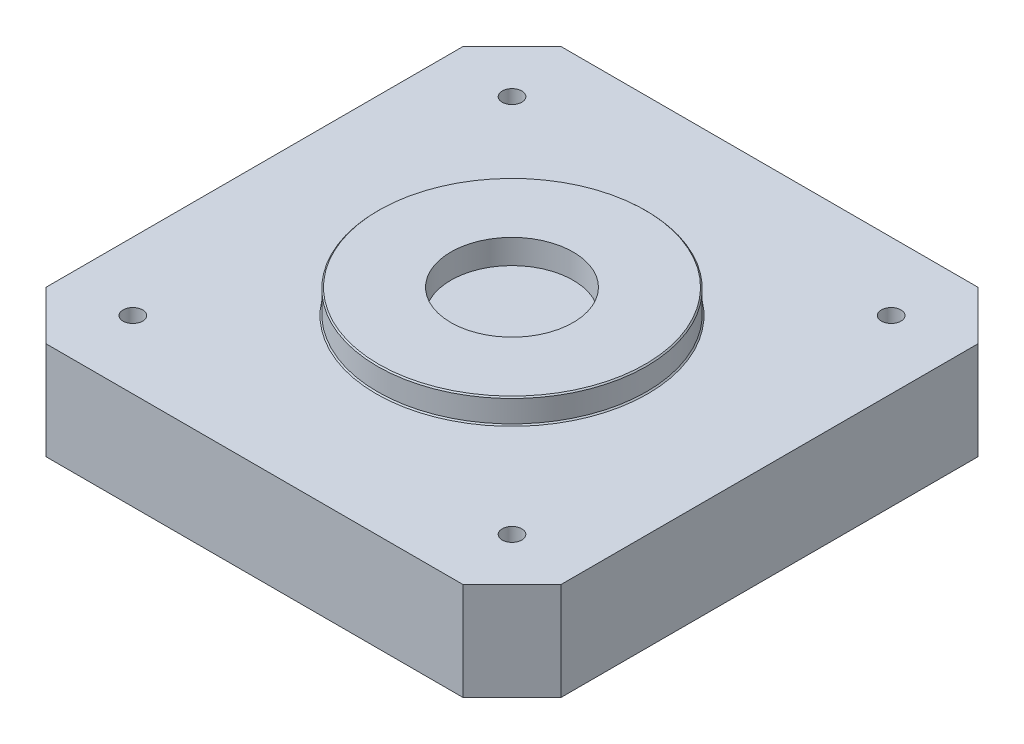
ISO-10303-21;
HEADER;
FILE_DESCRIPTION(('STEP AP214'),'2;1');
FILE_NAME('part.step','',(''),(''),'','','');
FILE_SCHEMA(('AUTOMOTIVE_DESIGN { 1 0 10303 214 1 1 1 1 }'));
ENDSEC;
DATA;
#1=APPLICATION_CONTEXT('core data for automotive mechanical design processes');
#2=APPLICATION_PROTOCOL_DEFINITION('international standard','automotive_design',2000,#1);
#3=PRODUCT_CONTEXT('',#1,'mechanical');
#4=PRODUCT('Part','Part','',(#3));
#5=PRODUCT_RELATED_PRODUCT_CATEGORY('part','',(#4));
#6=PRODUCT_DEFINITION_FORMATION('','',#4);
#7=PRODUCT_DEFINITION_CONTEXT('part definition',#1,'design');
#8=PRODUCT_DEFINITION('design','',#6,#7);
#9=PRODUCT_DEFINITION_SHAPE('','',#8);
#10=(LENGTH_UNIT() NAMED_UNIT(*) SI_UNIT(.MILLI.,.METRE.));
#11=(NAMED_UNIT(*) PLANE_ANGLE_UNIT() SI_UNIT($,.RADIAN.));
#12=(NAMED_UNIT(*) SI_UNIT($,.STERADIAN.) SOLID_ANGLE_UNIT());
#13=UNCERTAINTY_MEASURE_WITH_UNIT(LENGTH_MEASURE(1.E-05),#10,'distance_accuracy_value','');
#14=(GEOMETRIC_REPRESENTATION_CONTEXT(3) GLOBAL_UNCERTAINTY_ASSIGNED_CONTEXT((#13)) GLOBAL_UNIT_ASSIGNED_CONTEXT((#10,
#11,#12)) REPRESENTATION_CONTEXT('',''));
#15=CARTESIAN_POINT('',(0.,0.,0.));
#16=DIRECTION('',(0.,0.,1.));
#17=DIRECTION('',(1.,0.,0.));
#18=AXIS2_PLACEMENT_3D('',#15,#16,#17);
#19=CARTESIAN_POINT('',(0.,8.,0.));
#20=DIRECTION('',(0.,-1.,0.));
#21=DIRECTION('',(0.,0.,-1.));
#22=AXIS2_PLACEMENT_3D('',#19,#20,#21);
#23=PLANE('',#22);
#24=CARTESIAN_POINT('',(-15.5,8.,-15.5));
#25=DIRECTION('',(0.,1.,0.));
#26=DIRECTION('',(0.,0.,1.));
#27=AXIS2_PLACEMENT_3D('',#24,#25,#26);
#28=CIRCLE('',#27,0.79999999999999);
#29=CARTESIAN_POINT('',(-15.5,8.,-14.7));
#30=VERTEX_POINT('',#29);
#31=EDGE_CURVE('E278',#30,#30,#28,.T.);
#32=ORIENTED_EDGE('',*,*,#31,.F.);
#33=EDGE_LOOP('',(#32));
#34=FACE_BOUND('',#33,.T.);
#35=CARTESIAN_POINT('',(15.5,8.,-15.5));
#36=DIRECTION('',(0.,1.,0.));
#37=DIRECTION('',(0.,0.,1.));
#38=AXIS2_PLACEMENT_3D('',#35,#36,#37);
#39=CIRCLE('',#38,0.799999999999988);
#40=CARTESIAN_POINT('',(15.5,8.,-14.7));
#41=VERTEX_POINT('',#40);
#42=EDGE_CURVE('E280',#41,#41,#39,.T.);
#43=ORIENTED_EDGE('',*,*,#42,.F.);
#44=EDGE_LOOP('',(#43));
#45=FACE_BOUND('',#44,.T.);
#46=CARTESIAN_POINT('',(15.5,8.,15.5));
#47=DIRECTION('',(0.,1.,0.));
#48=DIRECTION('',(0.,0.,1.));
#49=AXIS2_PLACEMENT_3D('',#46,#47,#48);
#50=CIRCLE('',#49,0.799999999999988);
#51=CARTESIAN_POINT('',(15.5,8.,16.3));
#52=VERTEX_POINT('',#51);
#53=EDGE_CURVE('E288',#52,#52,#50,.T.);
#54=ORIENTED_EDGE('',*,*,#53,.F.);
#55=EDGE_LOOP('',(#54));
#56=FACE_BOUND('',#55,.T.);
#57=CARTESIAN_POINT('',(0.,8.,0.));
#58=DIRECTION('',(0.,-1.,0.));
#59=DIRECTION('',(0.,0.,-1.));
#60=AXIS2_PLACEMENT_3D('',#57,#58,#59);
#61=CIRCLE('',#60,11.1);
#62=CARTESIAN_POINT('',(0.,8.,-11.1));
#63=VERTEX_POINT('',#62);
#64=EDGE_CURVE('E11',#63,#63,#61,.T.);
#65=ORIENTED_EDGE('',*,*,#64,.T.);
#66=EDGE_LOOP('',(#65));
#67=FACE_BOUND('',#66,.T.);
#68=DIRECTION('',(-1.,0.,0.));
#69=VECTOR('',#68,1.);
#70=CARTESIAN_POINT('',(-21.05,8.,-21.05));
#71=LINE('',#70,#69);
#72=CARTESIAN_POINT('',(17.05,8.,-21.05));
#73=VERTEX_POINT('',#72);
#74=CARTESIAN_POINT('',(-17.05,8.,-21.05));
#75=VERTEX_POINT('',#74);
#76=EDGE_CURVE('E200',#73,#75,#71,.T.);
#77=ORIENTED_EDGE('',*,*,#76,.T.);
#78=DIRECTION('',(0.707106781186549,0.,-0.707106781186546));
#79=VECTOR('',#78,1.);
#80=CARTESIAN_POINT('',(-21.05,8.,-17.05));
#81=LINE('',#80,#79);
#82=CARTESIAN_POINT('',(-21.05,8.,-17.05));
#83=VERTEX_POINT('',#82);
#84=EDGE_CURVE('E152',#75,#83,#81,.F.);
#85=ORIENTED_EDGE('',*,*,#84,.T.);
#86=DIRECTION('',(0.,0.,1.));
#87=VECTOR('',#86,1.);
#88=CARTESIAN_POINT('',(-21.05,8.,21.05));
#89=LINE('',#88,#87);
#90=CARTESIAN_POINT('',(-21.05,8.,17.05));
#91=VERTEX_POINT('',#90);
#92=EDGE_CURVE('E123',#83,#91,#89,.T.);
#93=ORIENTED_EDGE('',*,*,#92,.T.);
#94=DIRECTION('',(-0.707106781186546,0.,-0.707106781186549));
#95=VECTOR('',#94,1.);
#96=CARTESIAN_POINT('',(-17.05,8.,21.05));
#97=LINE('',#96,#95);
#98=CARTESIAN_POINT('',(-17.05,8.,21.05));
#99=VERTEX_POINT('',#98);
#100=EDGE_CURVE('E59',#91,#99,#97,.F.);
#101=ORIENTED_EDGE('',*,*,#100,.T.);
#102=DIRECTION('',(1.,0.,0.));
#103=VECTOR('',#102,1.);
#104=CARTESIAN_POINT('',(-21.05,8.,21.05));
#105=LINE('',#104,#103);
#106=CARTESIAN_POINT('',(17.05,8.,21.05));
#107=VERTEX_POINT('',#106);
#108=EDGE_CURVE('E138',#99,#107,#105,.T.);
#109=ORIENTED_EDGE('',*,*,#108,.T.);
#110=DIRECTION('',(-0.707106781186549,0.,0.707106781186546));
#111=VECTOR('',#110,1.);
#112=CARTESIAN_POINT('',(21.05,8.,17.05));
#113=LINE('',#112,#111);
#114=CARTESIAN_POINT('',(21.05,8.,17.05));
#115=VERTEX_POINT('',#114);
#116=EDGE_CURVE('E147',#107,#115,#113,.F.);
#117=ORIENTED_EDGE('',*,*,#116,.T.);
#118=DIRECTION('',(0.,0.,-1.));
#119=VECTOR('',#118,1.);
#120=CARTESIAN_POINT('',(21.05,8.,21.05));
#121=LINE('',#120,#119);
#122=CARTESIAN_POINT('',(21.05,8.,-17.05));
#123=VERTEX_POINT('',#122);
#124=EDGE_CURVE('E132',#115,#123,#121,.T.);
#125=ORIENTED_EDGE('',*,*,#124,.T.);
#126=DIRECTION('',(0.707106781186546,0.,0.707106781186549));
#127=VECTOR('',#126,1.);
#128=CARTESIAN_POINT('',(17.05,8.,-21.05));
#129=LINE('',#128,#127);
#130=EDGE_CURVE('E149',#123,#73,#129,.F.);
#131=ORIENTED_EDGE('',*,*,#130,.T.);
#132=EDGE_LOOP('',(#77,#85,#93,#101,#109,#117,#125,#131));
#133=FACE_BOUND('',#132,.T.);
#134=CARTESIAN_POINT('',(-15.5,8.,15.5));
#135=DIRECTION('',(0.,1.,0.));
#136=DIRECTION('',(0.,0.,1.));
#137=AXIS2_PLACEMENT_3D('',#134,#135,#136);
#138=CIRCLE('',#137,0.79999999999999);
#139=CARTESIAN_POINT('',(-15.5,8.,16.3));
#140=VERTEX_POINT('',#139);
#141=EDGE_CURVE('E293',#140,#140,#138,.T.);
#142=ORIENTED_EDGE('',*,*,#141,.F.);
#143=EDGE_LOOP('',(#142));
#144=FACE_BOUND('',#143,.T.);
#145=ADVANCED_FACE('F37',(#34,#45,#56,#67,#133,#144),#23,.F.);
#146=CARTESIAN_POINT('',(21.05,8.,21.05));
#147=DIRECTION('',(-1.,0.,0.));
#148=DIRECTION('',(0.,0.,1.));
#149=AXIS2_PLACEMENT_3D('',#146,#147,#148);
#150=PLANE('',#149);
#151=DIRECTION('',(0.,0.,-1.));
#152=VECTOR('',#151,1.);
#153=CARTESIAN_POINT('',(21.05,0.,21.05));
#154=LINE('',#153,#152);
#155=CARTESIAN_POINT('',(21.05,0.,17.05));
#156=VERTEX_POINT('',#155);
#157=CARTESIAN_POINT('',(21.05,0.,-17.05));
#158=VERTEX_POINT('',#157);
#159=EDGE_CURVE('E134',#156,#158,#154,.T.);
#160=ORIENTED_EDGE('',*,*,#159,.T.);
#161=DIRECTION('',(0.,1.,0.));
#162=VECTOR('',#161,1.);
#163=CARTESIAN_POINT('',(21.05,8.,-17.05));
#164=LINE('',#163,#162);
#165=EDGE_CURVE('E161',#158,#123,#164,.T.);
#166=ORIENTED_EDGE('',*,*,#165,.T.);
#167=ORIENTED_EDGE('',*,*,#124,.F.);
#168=DIRECTION('',(0.,-1.,0.));
#169=VECTOR('',#168,1.);
#170=CARTESIAN_POINT('',(21.05,8.,17.05));
#171=LINE('',#170,#169);
#172=EDGE_CURVE('E158',#115,#156,#171,.T.);
#173=ORIENTED_EDGE('',*,*,#172,.T.);
#174=EDGE_LOOP('',(#160,#166,#167,#173));
#175=FACE_BOUND('',#174,.T.);
#176=ADVANCED_FACE('F212',(#175),#150,.F.);
#177=CARTESIAN_POINT('',(-21.05,8.,-21.05));
#178=DIRECTION('',(0.,0.,1.));
#179=DIRECTION('',(1.,0.,0.));
#180=AXIS2_PLACEMENT_3D('',#177,#178,#179);
#181=PLANE('',#180);
#182=DIRECTION('',(-1.,0.,0.));
#183=VECTOR('',#182,1.);
#184=CARTESIAN_POINT('',(-21.05,0.,-21.05));
#185=LINE('',#184,#183);
#186=CARTESIAN_POINT('',(17.05,0.,-21.05));
#187=VERTEX_POINT('',#186);
#188=CARTESIAN_POINT('',(-17.05,0.,-21.05));
#189=VERTEX_POINT('',#188);
#190=EDGE_CURVE('E130',#187,#189,#185,.T.);
#191=ORIENTED_EDGE('',*,*,#190,.T.);
#192=DIRECTION('',(0.,1.,0.));
#193=VECTOR('',#192,1.);
#194=CARTESIAN_POINT('',(-17.05,8.,-21.05));
#195=LINE('',#194,#193);
#196=EDGE_CURVE('E109',#189,#75,#195,.T.);
#197=ORIENTED_EDGE('',*,*,#196,.T.);
#198=ORIENTED_EDGE('',*,*,#76,.F.);
#199=DIRECTION('',(0.,-1.,0.));
#200=VECTOR('',#199,1.);
#201=CARTESIAN_POINT('',(17.05,8.,-21.05));
#202=LINE('',#201,#200);
#203=EDGE_CURVE('E114',#73,#187,#202,.T.);
#204=ORIENTED_EDGE('',*,*,#203,.T.);
#205=EDGE_LOOP('',(#191,#197,#198,#204));
#206=FACE_BOUND('',#205,.T.);
#207=ADVANCED_FACE('F220',(#206),#181,.F.);
#208=CARTESIAN_POINT('',(-21.05,8.,21.05));
#209=DIRECTION('',(1.,0.,0.));
#210=DIRECTION('',(0.,0.,-1.));
#211=AXIS2_PLACEMENT_3D('',#208,#209,#210);
#212=PLANE('',#211);
#213=ORIENTED_EDGE('',*,*,#92,.F.);
#214=DIRECTION('',(0.,-1.,0.));
#215=VECTOR('',#214,1.);
#216=CARTESIAN_POINT('',(-21.05,8.,-17.05));
#217=LINE('',#216,#215);
#218=CARTESIAN_POINT('',(-21.05,0.,-17.05));
#219=VERTEX_POINT('',#218);
#220=EDGE_CURVE('E108',#83,#219,#217,.T.);
#221=ORIENTED_EDGE('',*,*,#220,.T.);
#222=DIRECTION('',(0.,0.,1.));
#223=VECTOR('',#222,1.);
#224=CARTESIAN_POINT('',(-21.05,0.,21.05));
#225=LINE('',#224,#223);
#226=CARTESIAN_POINT('',(-21.05,0.,17.05));
#227=VERTEX_POINT('',#226);
#228=EDGE_CURVE('E121',#219,#227,#225,.T.);
#229=ORIENTED_EDGE('',*,*,#228,.T.);
#230=DIRECTION('',(0.,1.,0.));
#231=VECTOR('',#230,1.);
#232=CARTESIAN_POINT('',(-21.05,8.,17.05));
#233=LINE('',#232,#231);
#234=EDGE_CURVE('E125',#227,#91,#233,.T.);
#235=ORIENTED_EDGE('',*,*,#234,.T.);
#236=EDGE_LOOP('',(#213,#221,#229,#235));
#237=FACE_BOUND('',#236,.T.);
#238=ADVANCED_FACE('F120',(#237),#212,.F.);
#239=CARTESIAN_POINT('',(-21.05,8.,21.05));
#240=DIRECTION('',(0.,0.,-1.));
#241=DIRECTION('',(-1.,0.,0.));
#242=AXIS2_PLACEMENT_3D('',#239,#240,#241);
#243=PLANE('',#242);
#244=ORIENTED_EDGE('',*,*,#108,.F.);
#245=DIRECTION('',(0.,-1.,0.));
#246=VECTOR('',#245,1.);
#247=CARTESIAN_POINT('',(-17.05,8.,21.05));
#248=LINE('',#247,#246);
#249=CARTESIAN_POINT('',(-17.05,0.,21.05));
#250=VERTEX_POINT('',#249);
#251=EDGE_CURVE('E155',#99,#250,#248,.T.);
#252=ORIENTED_EDGE('',*,*,#251,.T.);
#253=DIRECTION('',(1.,0.,0.));
#254=VECTOR('',#253,1.);
#255=CARTESIAN_POINT('',(-21.05,0.,21.05));
#256=LINE('',#255,#254);
#257=CARTESIAN_POINT('',(17.05,0.,21.05));
#258=VERTEX_POINT('',#257);
#259=EDGE_CURVE('E129',#250,#258,#256,.T.);
#260=ORIENTED_EDGE('',*,*,#259,.T.);
#261=DIRECTION('',(0.,1.,0.));
#262=VECTOR('',#261,1.);
#263=CARTESIAN_POINT('',(17.05,8.,21.05));
#264=LINE('',#263,#262);
#265=EDGE_CURVE('E52',#258,#107,#264,.T.);
#266=ORIENTED_EDGE('',*,*,#265,.T.);
#267=EDGE_LOOP('',(#244,#252,#260,#266));
#268=FACE_BOUND('',#267,.T.);
#269=ADVANCED_FACE('F223',(#268),#243,.F.);
#270=CARTESIAN_POINT('',(0.,0.,0.));
#271=DIRECTION('',(0.,-1.,0.));
#272=DIRECTION('',(0.,0.,-1.));
#273=AXIS2_PLACEMENT_3D('',#270,#271,#272);
#274=PLANE('',#273);
#275=CARTESIAN_POINT('',(-15.5,0.,-15.5));
#276=DIRECTION('',(0.,1.,0.));
#277=DIRECTION('',(0.,0.,1.));
#278=AXIS2_PLACEMENT_3D('',#275,#276,#277);
#279=CIRCLE('',#278,0.799999999999999);
#280=CARTESIAN_POINT('',(-15.5,0.,-14.7));
#281=VERTEX_POINT('',#280);
#282=EDGE_CURVE('E276',#281,#281,#279,.T.);
#283=ORIENTED_EDGE('',*,*,#282,.T.);
#284=EDGE_LOOP('',(#283));
#285=FACE_BOUND('',#284,.T.);
#286=CARTESIAN_POINT('',(15.5,0.,-15.5));
#287=DIRECTION('',(0.,1.,0.));
#288=DIRECTION('',(0.,0.,1.));
#289=AXIS2_PLACEMENT_3D('',#286,#287,#288);
#290=CIRCLE('',#289,0.799999999999999);
#291=CARTESIAN_POINT('',(15.5,0.,-14.7));
#292=VERTEX_POINT('',#291);
#293=EDGE_CURVE('E285',#292,#292,#290,.T.);
#294=ORIENTED_EDGE('',*,*,#293,.T.);
#295=EDGE_LOOP('',(#294));
#296=FACE_BOUND('',#295,.T.);
#297=CARTESIAN_POINT('',(15.5,0.,15.5));
#298=DIRECTION('',(0.,1.,0.));
#299=DIRECTION('',(0.,0.,1.));
#300=AXIS2_PLACEMENT_3D('',#297,#298,#299);
#301=CIRCLE('',#300,0.799999999999999);
#302=CARTESIAN_POINT('',(15.5,0.,16.3));
#303=VERTEX_POINT('',#302);
#304=EDGE_CURVE('E291',#303,#303,#301,.T.);
#305=ORIENTED_EDGE('',*,*,#304,.T.);
#306=EDGE_LOOP('',(#305));
#307=FACE_BOUND('',#306,.T.);
#308=CARTESIAN_POINT('',(-15.5,0.,15.5));
#309=DIRECTION('',(0.,1.,0.));
#310=DIRECTION('',(0.,0.,1.));
#311=AXIS2_PLACEMENT_3D('',#308,#309,#310);
#312=CIRCLE('',#311,0.799999999999999);
#313=CARTESIAN_POINT('',(-15.5,0.,16.3));
#314=VERTEX_POINT('',#313);
#315=EDGE_CURVE('E193',#314,#314,#312,.T.);
#316=ORIENTED_EDGE('',*,*,#315,.T.);
#317=EDGE_LOOP('',(#316));
#318=FACE_BOUND('',#317,.T.);
#319=ORIENTED_EDGE('',*,*,#228,.F.);
#320=DIRECTION('',(-0.707106781186549,0.,0.707106781186546));
#321=VECTOR('',#320,1.);
#322=CARTESIAN_POINT('',(-19.05,0.,-19.05));
#323=LINE('',#322,#321);
#324=EDGE_CURVE('E104',#219,#189,#323,.F.);
#325=ORIENTED_EDGE('',*,*,#324,.T.);
#326=ORIENTED_EDGE('',*,*,#190,.F.);
#327=DIRECTION('',(-0.707106781186546,0.,-0.707106781186549));
#328=VECTOR('',#327,1.);
#329=CARTESIAN_POINT('',(19.05,0.,-19.05));
#330=LINE('',#329,#328);
#331=EDGE_CURVE('E141',#187,#158,#330,.F.);
#332=ORIENTED_EDGE('',*,*,#331,.T.);
#333=ORIENTED_EDGE('',*,*,#159,.F.);
#334=DIRECTION('',(0.707106781186549,0.,-0.707106781186546));
#335=VECTOR('',#334,1.);
#336=CARTESIAN_POINT('',(19.05,0.,19.05));
#337=LINE('',#336,#335);
#338=EDGE_CURVE('E124',#156,#258,#337,.F.);
#339=ORIENTED_EDGE('',*,*,#338,.T.);
#340=ORIENTED_EDGE('',*,*,#259,.F.);
#341=DIRECTION('',(0.707106781186546,0.,0.707106781186549));
#342=VECTOR('',#341,1.);
#343=CARTESIAN_POINT('',(-19.05,0.,19.05));
#344=LINE('',#343,#342);
#345=EDGE_CURVE('E115',#250,#227,#344,.F.);
#346=ORIENTED_EDGE('',*,*,#345,.T.);
#347=EDGE_LOOP('',(#319,#325,#326,#332,#333,#339,#340,#346));
#348=FACE_BOUND('',#347,.T.);
#349=ADVANCED_FACE('F127',(#285,#296,#307,#318,#348),#274,.T.);
#350=CARTESIAN_POINT('',(-21.05,8.,-17.05));
#351=DIRECTION('',(0.707106781186546,0.,0.707106781186549));
#352=DIRECTION('',(0.,-1.,0.));
#353=AXIS2_PLACEMENT_3D('',#350,#351,#352);
#354=PLANE('',#353);
#355=ORIENTED_EDGE('',*,*,#84,.F.);
#356=ORIENTED_EDGE('',*,*,#196,.F.);
#357=ORIENTED_EDGE('',*,*,#324,.F.);
#358=ORIENTED_EDGE('',*,*,#220,.F.);
#359=EDGE_LOOP('',(#355,#356,#357,#358));
#360=FACE_BOUND('',#359,.T.);
#361=ADVANCED_FACE('F107',(#360),#354,.F.);
#362=CARTESIAN_POINT('',(-17.05,8.,21.05));
#363=DIRECTION('',(0.707106781186549,0.,-0.707106781186546));
#364=DIRECTION('',(0.,-1.,0.));
#365=AXIS2_PLACEMENT_3D('',#362,#363,#364);
#366=PLANE('',#365);
#367=ORIENTED_EDGE('',*,*,#100,.F.);
#368=ORIENTED_EDGE('',*,*,#234,.F.);
#369=ORIENTED_EDGE('',*,*,#345,.F.);
#370=ORIENTED_EDGE('',*,*,#251,.F.);
#371=EDGE_LOOP('',(#367,#368,#369,#370));
#372=FACE_BOUND('',#371,.T.);
#373=ADVANCED_FACE('F222',(#372),#366,.F.);
#374=CARTESIAN_POINT('',(17.05,8.,-21.05));
#375=DIRECTION('',(-0.707106781186549,0.,0.707106781186546));
#376=DIRECTION('',(0.,-1.,0.));
#377=AXIS2_PLACEMENT_3D('',#374,#375,#376);
#378=PLANE('',#377);
#379=ORIENTED_EDGE('',*,*,#130,.F.);
#380=ORIENTED_EDGE('',*,*,#165,.F.);
#381=ORIENTED_EDGE('',*,*,#331,.F.);
#382=ORIENTED_EDGE('',*,*,#203,.F.);
#383=EDGE_LOOP('',(#379,#380,#381,#382));
#384=FACE_BOUND('',#383,.T.);
#385=ADVANCED_FACE('F217',(#384),#378,.F.);
#386=CARTESIAN_POINT('',(21.05,8.,17.05));
#387=DIRECTION('',(-0.707106781186546,0.,-0.707106781186549));
#388=DIRECTION('',(0.,-1.,0.));
#389=AXIS2_PLACEMENT_3D('',#386,#387,#388);
#390=PLANE('',#389);
#391=ORIENTED_EDGE('',*,*,#116,.F.);
#392=ORIENTED_EDGE('',*,*,#265,.F.);
#393=ORIENTED_EDGE('',*,*,#338,.F.);
#394=ORIENTED_EDGE('',*,*,#172,.F.);
#395=EDGE_LOOP('',(#391,#392,#393,#394));
#396=FACE_BOUND('',#395,.T.);
#397=ADVANCED_FACE('F183',(#396),#390,.F.);
#398=CARTESIAN_POINT('',(0.,10.,0.));
#399=DIRECTION('',(0.,1.,0.));
#400=DIRECTION('',(0.,0.,1.));
#401=AXIS2_PLACEMENT_3D('',#398,#399,#400);
#402=PLANE('',#401);
#403=CARTESIAN_POINT('',(0.,10.,0.));
#404=DIRECTION('',(0.,1.,0.));
#405=DIRECTION('',(0.,0.,1.));
#406=AXIS2_PLACEMENT_3D('',#403,#404,#405);
#407=CIRCLE('',#406,10.9);
#408=CARTESIAN_POINT('',(0.,10.,10.9));
#409=VERTEX_POINT('',#408);
#410=EDGE_CURVE('E163',#409,#409,#407,.T.);
#411=ORIENTED_EDGE('',*,*,#410,.T.);
#412=EDGE_LOOP('',(#411));
#413=FACE_BOUND('',#412,.T.);
#414=CARTESIAN_POINT('',(0.,10.,0.));
#415=DIRECTION('',(0.,1.,0.));
#416=DIRECTION('',(0.,0.,1.));
#417=AXIS2_PLACEMENT_3D('',#414,#415,#416);
#418=CIRCLE('',#417,5.);
#419=CARTESIAN_POINT('',(0.,10.,5.));
#420=VERTEX_POINT('',#419);
#421=EDGE_CURVE('E187',#420,#420,#418,.T.);
#422=ORIENTED_EDGE('',*,*,#421,.F.);
#423=EDGE_LOOP('',(#422));
#424=FACE_BOUND('',#423,.T.);
#425=ADVANCED_FACE('F180',(#413,#424),#402,.T.);
#426=CARTESIAN_POINT('',(0.,10.,0.));
#427=DIRECTION('',(0.,-1.,0.));
#428=DIRECTION('',(0.,0.,-1.));
#429=AXIS2_PLACEMENT_3D('',#426,#427,#428);
#430=CYLINDRICAL_SURFACE('',#429,11.);
#431=CARTESIAN_POINT('',(0.,9.9,0.));
#432=DIRECTION('',(0.,1.,0.));
#433=DIRECTION('',(0.,0.,1.));
#434=AXIS2_PLACEMENT_3D('',#431,#432,#433);
#435=CIRCLE('',#434,11.);
#436=CARTESIAN_POINT('',(0.,9.9,11.));
#437=VERTEX_POINT('',#436);
#438=EDGE_CURVE('E45',#437,#437,#435,.F.);
#439=ORIENTED_EDGE('',*,*,#438,.T.);
#440=EDGE_LOOP('',(#439));
#441=FACE_BOUND('',#440,.T.);
#442=CARTESIAN_POINT('',(0.,8.1,0.));
#443=DIRECTION('',(0.,-1.,0.));
#444=DIRECTION('',(0.,0.,-1.));
#445=AXIS2_PLACEMENT_3D('',#442,#443,#444);
#446=CIRCLE('',#445,11.);
#447=CARTESIAN_POINT('',(0.,8.1,-11.));
#448=VERTEX_POINT('',#447);
#449=EDGE_CURVE('E166',#448,#448,#446,.F.);
#450=ORIENTED_EDGE('',*,*,#449,.T.);
#451=EDGE_LOOP('',(#450));
#452=FACE_BOUND('',#451,.T.);
#453=ADVANCED_FACE('F171',(#441,#452),#430,.T.);
#454=CARTESIAN_POINT('',(0.,10.,0.));
#455=DIRECTION('',(0.,-1.,0.));
#456=DIRECTION('',(0.,0.,-1.));
#457=AXIS2_PLACEMENT_3D('',#454,#455,#456);
#458=CYLINDRICAL_SURFACE('',#457,5.);
#459=ORIENTED_EDGE('',*,*,#421,.T.);
#460=EDGE_LOOP('',(#459));
#461=FACE_BOUND('',#460,.T.);
#462=CARTESIAN_POINT('',(0.,8.,0.));
#463=DIRECTION('',(0.,1.,0.));
#464=DIRECTION('',(0.,0.,1.));
#465=AXIS2_PLACEMENT_3D('',#462,#463,#464);
#466=CIRCLE('',#465,5.);
#467=CARTESIAN_POINT('',(0.,8.,5.));
#468=VERTEX_POINT('',#467);
#469=EDGE_CURVE('E189',#468,#468,#466,.T.);
#470=ORIENTED_EDGE('',*,*,#469,.F.);
#471=EDGE_LOOP('',(#470));
#472=FACE_BOUND('',#471,.T.);
#473=ADVANCED_FACE('F244',(#461,#472),#458,.F.);
#474=ORIENTED_EDGE('',*,*,#469,.T.);
#475=EDGE_LOOP('',(#474));
#476=FACE_BOUND('',#475,.T.);
#477=ADVANCED_FACE('F177',(#476),#23,.F.);
#478=CARTESIAN_POINT('',(0.,10.,0.));
#479=DIRECTION('',(0.,-1.,0.));
#480=DIRECTION('',(0.,0.,-1.));
#481=AXIS2_PLACEMENT_3D('',#478,#479,#480);
#482=CONICAL_SURFACE('',#481,10.9,0.785398163397431);
#483=ORIENTED_EDGE('',*,*,#438,.F.);
#484=EDGE_LOOP('',(#483));
#485=FACE_BOUND('',#484,.T.);
#486=ORIENTED_EDGE('',*,*,#410,.F.);
#487=EDGE_LOOP('',(#486));
#488=FACE_BOUND('',#487,.T.);
#489=ADVANCED_FACE('F174',(#485,#488),#482,.T.);
#490=CARTESIAN_POINT('',(0.,8.1,0.));
#491=DIRECTION('',(0.,-1.,0.));
#492=DIRECTION('',(0.,0.,-1.));
#493=AXIS2_PLACEMENT_3D('',#490,#491,#492);
#494=CONICAL_SURFACE('',#493,11.,0.785398163397466);
#495=ORIENTED_EDGE('',*,*,#64,.F.);
#496=EDGE_LOOP('',(#495));
#497=FACE_BOUND('',#496,.T.);
#498=ORIENTED_EDGE('',*,*,#449,.F.);
#499=EDGE_LOOP('',(#498));
#500=FACE_BOUND('',#499,.T.);
#501=ADVANCED_FACE('F39',(#497,#500),#494,.T.);
#502=CARTESIAN_POINT('',(-15.5,8.,15.5));
#503=DIRECTION('',(0.,1.,0.));
#504=DIRECTION('',(0.,0.,1.));
#505=AXIS2_PLACEMENT_3D('',#502,#503,#504);
#506=CYLINDRICAL_SURFACE('',#505,0.799999999999994);
#507=ORIENTED_EDGE('',*,*,#315,.F.);
#508=EDGE_LOOP('',(#507));
#509=FACE_BOUND('',#508,.T.);
#510=ORIENTED_EDGE('',*,*,#141,.T.);
#511=EDGE_LOOP('',(#510));
#512=FACE_BOUND('',#511,.T.);
#513=ADVANCED_FACE('F256',(#509,#512),#506,.F.);
#514=CARTESIAN_POINT('',(15.5,8.,15.5));
#515=DIRECTION('',(0.,1.,0.));
#516=DIRECTION('',(0.,0.,1.));
#517=AXIS2_PLACEMENT_3D('',#514,#515,#516);
#518=CYLINDRICAL_SURFACE('',#517,0.799999999999993);
#519=ORIENTED_EDGE('',*,*,#304,.F.);
#520=EDGE_LOOP('',(#519));
#521=FACE_BOUND('',#520,.T.);
#522=ORIENTED_EDGE('',*,*,#53,.T.);
#523=EDGE_LOOP('',(#522));
#524=FACE_BOUND('',#523,.T.);
#525=ADVANCED_FACE('F259',(#521,#524),#518,.F.);
#526=CARTESIAN_POINT('',(15.5,8.,-15.5));
#527=DIRECTION('',(0.,1.,0.));
#528=DIRECTION('',(0.,0.,1.));
#529=AXIS2_PLACEMENT_3D('',#526,#527,#528);
#530=CYLINDRICAL_SURFACE('',#529,0.799999999999993);
#531=ORIENTED_EDGE('',*,*,#293,.F.);
#532=EDGE_LOOP('',(#531));
#533=FACE_BOUND('',#532,.T.);
#534=ORIENTED_EDGE('',*,*,#42,.T.);
#535=EDGE_LOOP('',(#534));
#536=FACE_BOUND('',#535,.T.);
#537=ADVANCED_FACE('F263',(#533,#536),#530,.F.);
#538=CARTESIAN_POINT('',(-15.5,8.,-15.5));
#539=DIRECTION('',(0.,1.,0.));
#540=DIRECTION('',(0.,0.,1.));
#541=AXIS2_PLACEMENT_3D('',#538,#539,#540);
#542=CYLINDRICAL_SURFACE('',#541,0.799999999999994);
#543=ORIENTED_EDGE('',*,*,#282,.F.);
#544=EDGE_LOOP('',(#543));
#545=FACE_BOUND('',#544,.T.);
#546=ORIENTED_EDGE('',*,*,#31,.T.);
#547=EDGE_LOOP('',(#546));
#548=FACE_BOUND('',#547,.T.);
#549=ADVANCED_FACE('F267',(#545,#548),#542,.F.);
#550=CLOSED_SHELL('',(#145,#176,#207,#238,#269,#349,#361,#373,#385,#397,#425,#453,#473,#477,
#489,#501,#513,#525,#537,#549));
#551=MANIFOLD_SOLID_BREP('B2',#550);
#552=ADVANCED_BREP_SHAPE_REPRESENTATION('',(#18,#551),#14);
#553=SHAPE_DEFINITION_REPRESENTATION(#9,#552);
ENDSEC;
END-ISO-10303-21;
